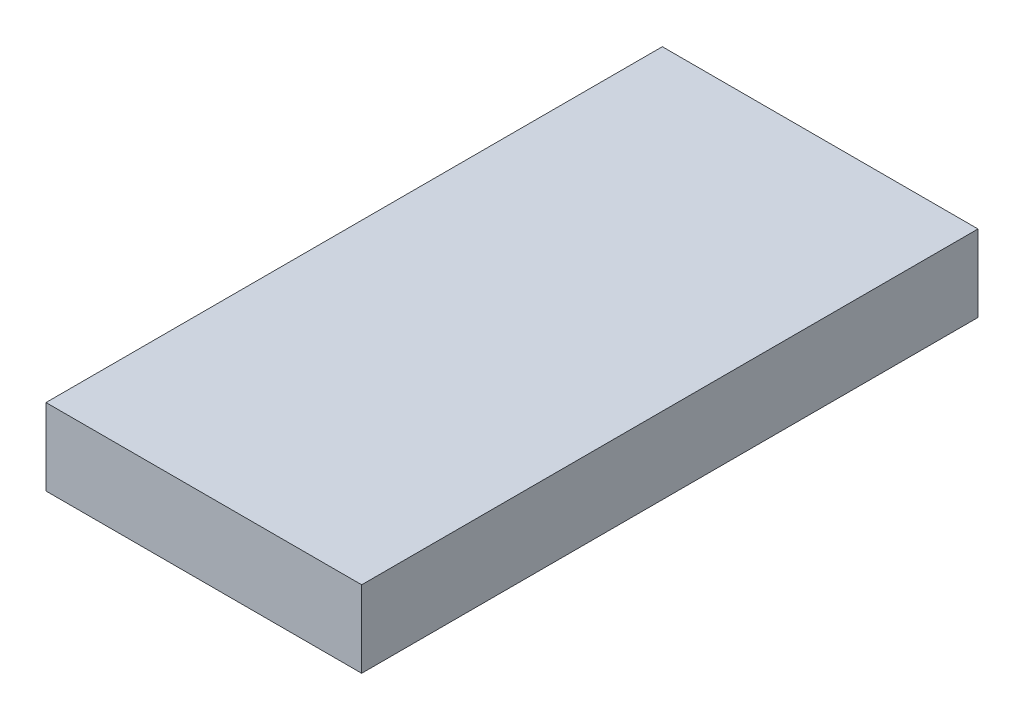
ISO-10303-21;
HEADER;
FILE_DESCRIPTION(('STEP AP214'),'2;1');
FILE_NAME('part.step','',(''),(''),'','','');
FILE_SCHEMA(('AUTOMOTIVE_DESIGN { 1 0 10303 214 1 1 1 1 }'));
ENDSEC;
DATA;
#1=APPLICATION_CONTEXT('core data for automotive mechanical design processes');
#2=APPLICATION_PROTOCOL_DEFINITION('international standard','automotive_design',2000,#1);
#3=PRODUCT_CONTEXT('',#1,'mechanical');
#4=PRODUCT('Part','Part','',(#3));
#5=PRODUCT_RELATED_PRODUCT_CATEGORY('part','',(#4));
#6=PRODUCT_DEFINITION_FORMATION('','',#4);
#7=PRODUCT_DEFINITION_CONTEXT('part definition',#1,'design');
#8=PRODUCT_DEFINITION('design','',#6,#7);
#9=PRODUCT_DEFINITION_SHAPE('','',#8);
#10=(LENGTH_UNIT() NAMED_UNIT(*) SI_UNIT(.MILLI.,.METRE.));
#11=(NAMED_UNIT(*) PLANE_ANGLE_UNIT() SI_UNIT($,.RADIAN.));
#12=(NAMED_UNIT(*) SI_UNIT($,.STERADIAN.) SOLID_ANGLE_UNIT());
#13=UNCERTAINTY_MEASURE_WITH_UNIT(LENGTH_MEASURE(1.E-05),#10,'distance_accuracy_value','');
#14=(GEOMETRIC_REPRESENTATION_CONTEXT(3) GLOBAL_UNCERTAINTY_ASSIGNED_CONTEXT((#13)) GLOBAL_UNIT_ASSIGNED_CONTEXT((#10,
#11,#12)) REPRESENTATION_CONTEXT('',''));
#15=CARTESIAN_POINT('',(0.,0.,0.));
#16=DIRECTION('',(0.,0.,1.));
#17=DIRECTION('',(1.,0.,0.));
#18=AXIS2_PLACEMENT_3D('',#15,#16,#17);
#19=CARTESIAN_POINT('',(-10.5,5.1,20.5));
#20=DIRECTION('',(1.,0.,0.));
#21=DIRECTION('',(0.,0.,-1.));
#22=AXIS2_PLACEMENT_3D('',#19,#20,#21);
#23=PLANE('',#22);
#24=DIRECTION('',(0.,0.,1.));
#25=VECTOR('',#24,1.);
#26=CARTESIAN_POINT('',(-10.5,0.,20.5));
#27=LINE('',#26,#25);
#28=CARTESIAN_POINT('',(-10.5,0.,-20.5));
#29=VERTEX_POINT('',#28);
#30=CARTESIAN_POINT('',(-10.5,0.,20.5));
#31=VERTEX_POINT('',#30);
#32=EDGE_CURVE('E96',#29,#31,#27,.T.);
#33=ORIENTED_EDGE('',*,*,#32,.T.);
#34=DIRECTION('',(0.,-1.,0.));
#35=VECTOR('',#34,1.);
#36=CARTESIAN_POINT('',(-10.5,5.1,20.5));
#37=LINE('',#36,#35);
#38=CARTESIAN_POINT('',(-10.5,5.1,20.5));
#39=VERTEX_POINT('',#38);
#40=EDGE_CURVE('E11',#39,#31,#37,.T.);
#41=ORIENTED_EDGE('',*,*,#40,.F.);
#42=DIRECTION('',(0.,0.,1.));
#43=VECTOR('',#42,1.);
#44=CARTESIAN_POINT('',(-10.5,5.1,20.5));
#45=LINE('',#44,#43);
#46=CARTESIAN_POINT('',(-10.5,5.1,-20.5));
#47=VERTEX_POINT('',#46);
#48=EDGE_CURVE('E84',#47,#39,#45,.T.);
#49=ORIENTED_EDGE('',*,*,#48,.F.);
#50=DIRECTION('',(0.,-1.,0.));
#51=VECTOR('',#50,1.);
#52=CARTESIAN_POINT('',(-10.5,5.1,-20.5));
#53=LINE('',#52,#51);
#54=EDGE_CURVE('E92',#47,#29,#53,.T.);
#55=ORIENTED_EDGE('',*,*,#54,.T.);
#56=EDGE_LOOP('',(#33,#41,#49,#55));
#57=FACE_BOUND('',#56,.T.);
#58=ADVANCED_FACE('F33',(#57),#23,.F.);
#59=CARTESIAN_POINT('',(10.5,5.1,20.5));
#60=DIRECTION('',(0.,0.,-1.));
#61=DIRECTION('',(-1.,0.,0.));
#62=AXIS2_PLACEMENT_3D('',#59,#60,#61);
#63=PLANE('',#62);
#64=DIRECTION('',(1.,0.,0.));
#65=VECTOR('',#64,1.);
#66=CARTESIAN_POINT('',(10.5,0.,20.5));
#67=LINE('',#66,#65);
#68=CARTESIAN_POINT('',(10.5,0.,20.5));
#69=VERTEX_POINT('',#68);
#70=EDGE_CURVE('E88',#31,#69,#67,.T.);
#71=ORIENTED_EDGE('',*,*,#70,.T.);
#72=DIRECTION('',(0.,-1.,0.));
#73=VECTOR('',#72,1.);
#74=CARTESIAN_POINT('',(10.5,5.1,20.5));
#75=LINE('',#74,#73);
#76=CARTESIAN_POINT('',(10.5,5.1,20.5));
#77=VERTEX_POINT('',#76);
#78=EDGE_CURVE('E41',#77,#69,#75,.T.);
#79=ORIENTED_EDGE('',*,*,#78,.F.);
#80=DIRECTION('',(1.,0.,0.));
#81=VECTOR('',#80,1.);
#82=CARTESIAN_POINT('',(10.5,5.1,20.5));
#83=LINE('',#82,#81);
#84=EDGE_CURVE('E79',#39,#77,#83,.T.);
#85=ORIENTED_EDGE('',*,*,#84,.F.);
#86=ORIENTED_EDGE('',*,*,#40,.T.);
#87=EDGE_LOOP('',(#71,#79,#85,#86));
#88=FACE_BOUND('',#87,.T.);
#89=ADVANCED_FACE('F87',(#88),#63,.F.);
#90=CARTESIAN_POINT('',(10.5,5.1,20.5));
#91=DIRECTION('',(-1.,0.,0.));
#92=DIRECTION('',(0.,0.,1.));
#93=AXIS2_PLACEMENT_3D('',#90,#91,#92);
#94=PLANE('',#93);
#95=DIRECTION('',(0.,0.,-1.));
#96=VECTOR('',#95,1.);
#97=CARTESIAN_POINT('',(10.5,0.,20.5));
#98=LINE('',#97,#96);
#99=CARTESIAN_POINT('',(10.5,0.,-20.5));
#100=VERTEX_POINT('',#99);
#101=EDGE_CURVE('E66',#69,#100,#98,.T.);
#102=ORIENTED_EDGE('',*,*,#101,.T.);
#103=DIRECTION('',(0.,-1.,0.));
#104=VECTOR('',#103,1.);
#105=CARTESIAN_POINT('',(10.5,5.1,-20.5));
#106=LINE('',#105,#104);
#107=CARTESIAN_POINT('',(10.5,5.1,-20.5));
#108=VERTEX_POINT('',#107);
#109=EDGE_CURVE('E89',#108,#100,#106,.T.);
#110=ORIENTED_EDGE('',*,*,#109,.F.);
#111=DIRECTION('',(0.,0.,-1.));
#112=VECTOR('',#111,1.);
#113=CARTESIAN_POINT('',(10.5,5.1,20.5));
#114=LINE('',#113,#112);
#115=EDGE_CURVE('E82',#77,#108,#114,.T.);
#116=ORIENTED_EDGE('',*,*,#115,.F.);
#117=ORIENTED_EDGE('',*,*,#78,.T.);
#118=EDGE_LOOP('',(#102,#110,#116,#117));
#119=FACE_BOUND('',#118,.T.);
#120=ADVANCED_FACE('F90',(#119),#94,.F.);
#121=CARTESIAN_POINT('',(10.5,5.1,-20.5));
#122=DIRECTION('',(0.,0.,1.));
#123=DIRECTION('',(1.,0.,0.));
#124=AXIS2_PLACEMENT_3D('',#121,#122,#123);
#125=PLANE('',#124);
#126=DIRECTION('',(-1.,0.,0.));
#127=VECTOR('',#126,1.);
#128=CARTESIAN_POINT('',(10.5,0.,-20.5));
#129=LINE('',#128,#127);
#130=EDGE_CURVE('E72',#100,#29,#129,.T.);
#131=ORIENTED_EDGE('',*,*,#130,.T.);
#132=ORIENTED_EDGE('',*,*,#54,.F.);
#133=DIRECTION('',(-1.,0.,0.));
#134=VECTOR('',#133,1.);
#135=CARTESIAN_POINT('',(10.5,5.1,-20.5));
#136=LINE('',#135,#134);
#137=EDGE_CURVE('E49',#108,#47,#136,.T.);
#138=ORIENTED_EDGE('',*,*,#137,.F.);
#139=ORIENTED_EDGE('',*,*,#109,.T.);
#140=EDGE_LOOP('',(#131,#132,#138,#139));
#141=FACE_BOUND('',#140,.T.);
#142=ADVANCED_FACE('F103',(#141),#125,.F.);
#143=CARTESIAN_POINT('',(-10.5,5.1,-20.5));
#144=DIRECTION('',(0.,1.,0.));
#145=DIRECTION('',(0.,0.,1.));
#146=AXIS2_PLACEMENT_3D('',#143,#144,#145);
#147=PLANE('',#146);
#148=ORIENTED_EDGE('',*,*,#48,.T.);
#149=ORIENTED_EDGE('',*,*,#84,.T.);
#150=ORIENTED_EDGE('',*,*,#115,.T.);
#151=ORIENTED_EDGE('',*,*,#137,.T.);
#152=EDGE_LOOP('',(#148,#149,#150,#151));
#153=FACE_BOUND('',#152,.T.);
#154=ADVANCED_FACE('F80',(#153),#147,.T.);
#155=CARTESIAN_POINT('',(-10.5,0.,-20.5));
#156=DIRECTION('',(0.,1.,0.));
#157=DIRECTION('',(0.,0.,1.));
#158=AXIS2_PLACEMENT_3D('',#155,#156,#157);
#159=PLANE('',#158);
#160=ORIENTED_EDGE('',*,*,#32,.F.);
#161=ORIENTED_EDGE('',*,*,#130,.F.);
#162=ORIENTED_EDGE('',*,*,#101,.F.);
#163=ORIENTED_EDGE('',*,*,#70,.F.);
#164=EDGE_LOOP('',(#160,#161,#162,#163));
#165=FACE_BOUND('',#164,.T.);
#166=ADVANCED_FACE('F106',(#165),#159,.F.);
#167=CLOSED_SHELL('',(#58,#89,#120,#142,#154,#166));
#168=MANIFOLD_SOLID_BREP('B2',#167);
#169=ADVANCED_BREP_SHAPE_REPRESENTATION('',(#18,#168),#14);
#170=SHAPE_DEFINITION_REPRESENTATION(#9,#169);
ENDSEC;
END-ISO-10303-21;
